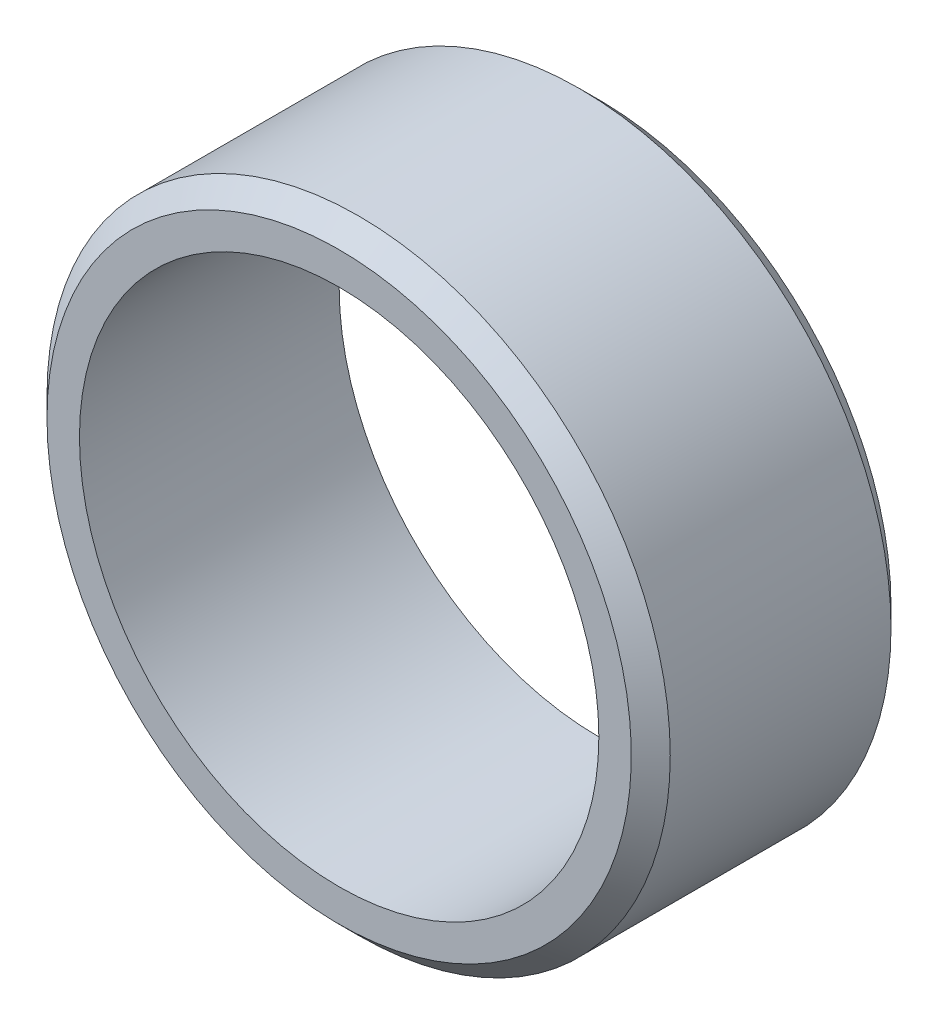
ISO-10303-21;
HEADER;
FILE_DESCRIPTION(('STEP AP214'),'2;1');
FILE_NAME('part.step','',(''),(''),'','','');
FILE_SCHEMA(('AUTOMOTIVE_DESIGN { 1 0 10303 214 1 1 1 1 }'));
ENDSEC;
DATA;
#1=APPLICATION_CONTEXT('core data for automotive mechanical design processes');
#2=APPLICATION_PROTOCOL_DEFINITION('international standard','automotive_design',2000,#1);
#3=PRODUCT_CONTEXT('',#1,'mechanical');
#4=PRODUCT('Part','Part','',(#3));
#5=PRODUCT_RELATED_PRODUCT_CATEGORY('part','',(#4));
#6=PRODUCT_DEFINITION_FORMATION('','',#4);
#7=PRODUCT_DEFINITION_CONTEXT('part definition',#1,'design');
#8=PRODUCT_DEFINITION('design','',#6,#7);
#9=PRODUCT_DEFINITION_SHAPE('','',#8);
#10=(LENGTH_UNIT() NAMED_UNIT(*) SI_UNIT(.MILLI.,.METRE.));
#11=(NAMED_UNIT(*) PLANE_ANGLE_UNIT() SI_UNIT($,.RADIAN.));
#12=(NAMED_UNIT(*) SI_UNIT($,.STERADIAN.) SOLID_ANGLE_UNIT());
#13=UNCERTAINTY_MEASURE_WITH_UNIT(LENGTH_MEASURE(1.E-05),#10,'distance_accuracy_value','');
#14=(GEOMETRIC_REPRESENTATION_CONTEXT(3) GLOBAL_UNCERTAINTY_ASSIGNED_CONTEXT((#13)) GLOBAL_UNIT_ASSIGNED_CONTEXT((#10,
#11,#12)) REPRESENTATION_CONTEXT('',''));
#15=CARTESIAN_POINT('',(0.,0.,0.));
#16=DIRECTION('',(0.,0.,1.));
#17=DIRECTION('',(1.,0.,0.));
#18=AXIS2_PLACEMENT_3D('',#15,#16,#17);
#19=CARTESIAN_POINT('',(0.,30.,12.5));
#20=DIRECTION('',(0.,0.,-1.));
#21=DIRECTION('',(-1.,0.,0.));
#22=AXIS2_PLACEMENT_3D('',#19,#20,#21);
#23=PLANE('',#22);
#24=CARTESIAN_POINT('',(0.,0.,12.5));
#25=DIRECTION('',(0.,0.,-1.));
#26=DIRECTION('',(-1.,0.,0.));
#27=AXIS2_PLACEMENT_3D('',#24,#25,#26);
#28=CIRCLE('',#27,28.125);
#29=CARTESIAN_POINT('',(-28.125,0.,12.5));
#30=VERTEX_POINT('',#29);
#31=EDGE_CURVE('E10',#30,#30,#28,.F.);
#32=ORIENTED_EDGE('',*,*,#31,.T.);
#33=EDGE_LOOP('',(#32));
#34=FACE_BOUND('',#33,.T.);
#35=CARTESIAN_POINT('',(0.,0.,12.5));
#36=DIRECTION('',(0.,0.,1.));
#37=DIRECTION('',(1.,0.,0.));
#38=AXIS2_PLACEMENT_3D('',#35,#36,#37);
#39=CIRCLE('',#38,25.);
#40=CARTESIAN_POINT('',(25.,0.,12.5));
#41=VERTEX_POINT('',#40);
#42=EDGE_CURVE('E53',#41,#41,#39,.T.);
#43=ORIENTED_EDGE('',*,*,#42,.F.);
#44=EDGE_LOOP('',(#43));
#45=FACE_BOUND('',#44,.T.);
#46=ADVANCED_FACE('F33',(#34,#45),#23,.F.);
#47=CARTESIAN_POINT('',(0.,0.,12.5));
#48=DIRECTION('',(0.,0.,1.));
#49=DIRECTION('',(1.,0.,0.));
#50=AXIS2_PLACEMENT_3D('',#47,#48,#49);
#51=CYLINDRICAL_SURFACE('',#50,25.);
#52=CARTESIAN_POINT('',(0.,0.,-12.5));
#53=DIRECTION('',(0.,0.,1.));
#54=DIRECTION('',(1.,0.,0.));
#55=AXIS2_PLACEMENT_3D('',#52,#53,#54);
#56=CIRCLE('',#55,25.);
#57=CARTESIAN_POINT('',(25.,0.,-12.5));
#58=VERTEX_POINT('',#57);
#59=EDGE_CURVE('E56',#58,#58,#56,.T.);
#60=ORIENTED_EDGE('',*,*,#59,.F.);
#61=EDGE_LOOP('',(#60));
#62=FACE_BOUND('',#61,.T.);
#63=ORIENTED_EDGE('',*,*,#42,.T.);
#64=EDGE_LOOP('',(#63));
#65=FACE_BOUND('',#64,.T.);
#66=ADVANCED_FACE('F62',(#62,#65),#51,.F.);
#67=CARTESIAN_POINT('',(0.,25.,-12.5));
#68=DIRECTION('',(0.,0.,1.));
#69=DIRECTION('',(1.,0.,0.));
#70=AXIS2_PLACEMENT_3D('',#67,#68,#69);
#71=PLANE('',#70);
#72=CARTESIAN_POINT('',(0.,0.,-12.5));
#73=DIRECTION('',(0.,0.,1.));
#74=DIRECTION('',(1.,0.,0.));
#75=AXIS2_PLACEMENT_3D('',#72,#73,#74);
#76=CIRCLE('',#75,28.125);
#77=CARTESIAN_POINT('',(28.125,0.,-12.5));
#78=VERTEX_POINT('',#77);
#79=EDGE_CURVE('E40',#78,#78,#76,.F.);
#80=ORIENTED_EDGE('',*,*,#79,.T.);
#81=EDGE_LOOP('',(#80));
#82=FACE_BOUND('',#81,.T.);
#83=ORIENTED_EDGE('',*,*,#59,.T.);
#84=EDGE_LOOP('',(#83));
#85=FACE_BOUND('',#84,.T.);
#86=ADVANCED_FACE('F60',(#82,#85),#71,.F.);
#87=CARTESIAN_POINT('',(0.,0.,12.5));
#88=DIRECTION('',(0.,0.,1.));
#89=DIRECTION('',(1.,0.,0.));
#90=AXIS2_PLACEMENT_3D('',#87,#88,#89);
#91=CYLINDRICAL_SURFACE('',#90,30.);
#92=CARTESIAN_POINT('',(0.,0.,-10.625));
#93=DIRECTION('',(0.,0.,1.));
#94=DIRECTION('',(1.,0.,0.));
#95=AXIS2_PLACEMENT_3D('',#92,#93,#94);
#96=CIRCLE('',#95,30.);
#97=CARTESIAN_POINT('',(30.,0.,-10.625));
#98=VERTEX_POINT('',#97);
#99=EDGE_CURVE('E44',#98,#98,#96,.T.);
#100=ORIENTED_EDGE('',*,*,#99,.T.);
#101=EDGE_LOOP('',(#100));
#102=FACE_BOUND('',#101,.T.);
#103=CARTESIAN_POINT('',(0.,0.,10.625));
#104=DIRECTION('',(0.,0.,-1.));
#105=DIRECTION('',(-1.,0.,0.));
#106=AXIS2_PLACEMENT_3D('',#103,#104,#105);
#107=CIRCLE('',#106,30.);
#108=CARTESIAN_POINT('',(-30.,0.,10.625));
#109=VERTEX_POINT('',#108);
#110=EDGE_CURVE('E48',#109,#109,#107,.T.);
#111=ORIENTED_EDGE('',*,*,#110,.T.);
#112=EDGE_LOOP('',(#111));
#113=FACE_BOUND('',#112,.T.);
#114=ADVANCED_FACE('F75',(#102,#113),#91,.T.);
#115=CARTESIAN_POINT('',(0.,0.,-10.625));
#116=DIRECTION('',(0.,0.,1.));
#117=DIRECTION('',(1.,0.,0.));
#118=AXIS2_PLACEMENT_3D('',#115,#116,#117);
#119=CONICAL_SURFACE('',#118,30.,0.785398163397452);
#120=ORIENTED_EDGE('',*,*,#79,.F.);
#121=EDGE_LOOP('',(#120));
#122=FACE_BOUND('',#121,.T.);
#123=ORIENTED_EDGE('',*,*,#99,.F.);
#124=EDGE_LOOP('',(#123));
#125=FACE_BOUND('',#124,.T.);
#126=ADVANCED_FACE('F73',(#122,#125),#119,.T.);
#127=CARTESIAN_POINT('',(0.,0.,12.5));
#128=DIRECTION('',(0.,0.,-1.));
#129=DIRECTION('',(-1.,0.,0.));
#130=AXIS2_PLACEMENT_3D('',#127,#128,#129);
#131=CONICAL_SURFACE('',#130,28.125,0.785398163397445);
#132=ORIENTED_EDGE('',*,*,#110,.F.);
#133=EDGE_LOOP('',(#132));
#134=FACE_BOUND('',#133,.T.);
#135=ORIENTED_EDGE('',*,*,#31,.F.);
#136=EDGE_LOOP('',(#135));
#137=FACE_BOUND('',#136,.T.);
#138=ADVANCED_FACE('F35',(#134,#137),#131,.T.);
#139=CLOSED_SHELL('',(#46,#66,#86,#114,#126,#138));
#140=MANIFOLD_SOLID_BREP('B2',#139);
#141=ADVANCED_BREP_SHAPE_REPRESENTATION('',(#18,#140),#14);
#142=SHAPE_DEFINITION_REPRESENTATION(#9,#141);
ENDSEC;
END-ISO-10303-21;
